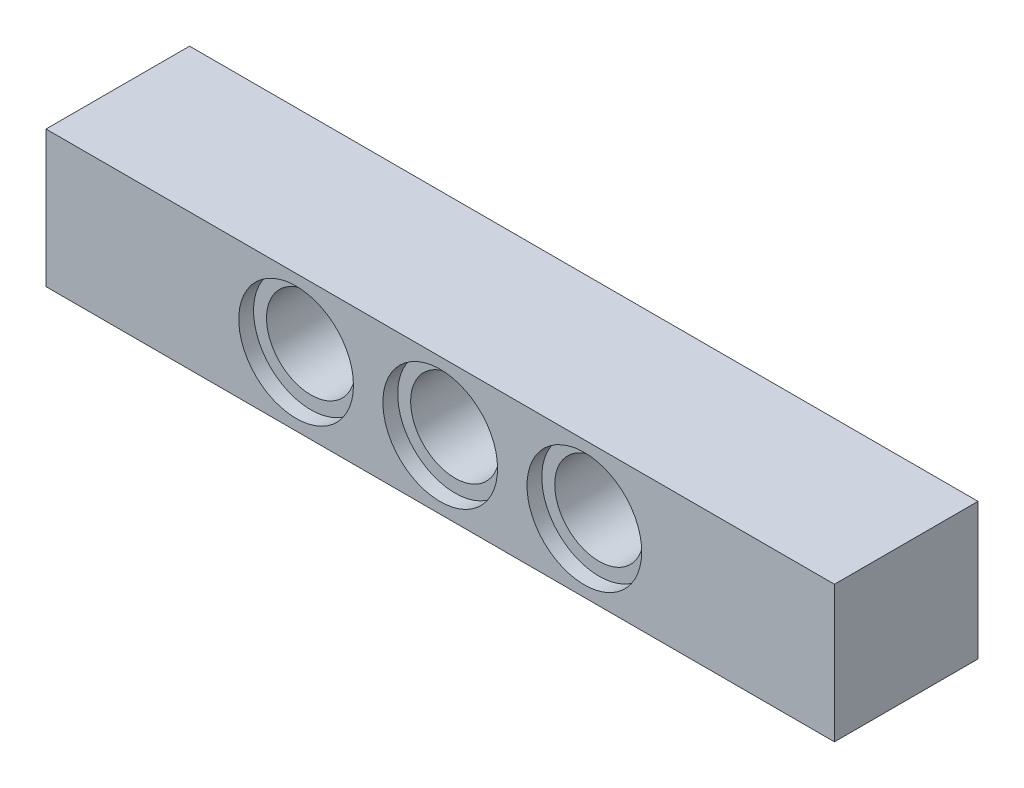
ISO-10303-21;
HEADER;
FILE_DESCRIPTION(('STEP AP214'),'2;1');
FILE_NAME('part.step','',(''),(''),'','','');
FILE_SCHEMA(('AUTOMOTIVE_DESIGN { 1 0 10303 214 1 1 1 1 }'));
ENDSEC;
DATA;
#1=APPLICATION_CONTEXT('core data for automotive mechanical design processes');
#2=APPLICATION_PROTOCOL_DEFINITION('international standard','automotive_design',2000,#1);
#3=PRODUCT_CONTEXT('',#1,'mechanical');
#4=PRODUCT('Part','Part','',(#3));
#5=PRODUCT_RELATED_PRODUCT_CATEGORY('part','',(#4));
#6=PRODUCT_DEFINITION_FORMATION('','',#4);
#7=PRODUCT_DEFINITION_CONTEXT('part definition',#1,'design');
#8=PRODUCT_DEFINITION('design','',#6,#7);
#9=PRODUCT_DEFINITION_SHAPE('','',#8);
#10=(LENGTH_UNIT() NAMED_UNIT(*) SI_UNIT(.MILLI.,.METRE.));
#11=(NAMED_UNIT(*) PLANE_ANGLE_UNIT() SI_UNIT($,.RADIAN.));
#12=(NAMED_UNIT(*) SI_UNIT($,.STERADIAN.) SOLID_ANGLE_UNIT());
#13=UNCERTAINTY_MEASURE_WITH_UNIT(LENGTH_MEASURE(1.E-05),#10,'distance_accuracy_value','');
#14=(GEOMETRIC_REPRESENTATION_CONTEXT(3) GLOBAL_UNCERTAINTY_ASSIGNED_CONTEXT((#13)) GLOBAL_UNIT_ASSIGNED_CONTEXT((#10,
#11,#12)) REPRESENTATION_CONTEXT('',''));
#15=CARTESIAN_POINT('',(0.,0.,0.));
#16=DIRECTION('',(0.,0.,1.));
#17=DIRECTION('',(1.,0.,0.));
#18=AXIS2_PLACEMENT_3D('',#15,#16,#17);
#19=CARTESIAN_POINT('',(27.29,3.69,0.));
#20=DIRECTION('',(0.,0.,1.));
#21=DIRECTION('',(1.,0.,0.));
#22=AXIS2_PLACEMENT_3D('',#19,#20,#21);
#23=CYLINDRICAL_SURFACE('',#22,3.1);
#24=CARTESIAN_POINT('',(27.29,3.69,0.));
#25=DIRECTION('',(0.,0.,1.));
#26=DIRECTION('',(1.,0.,0.));
#27=AXIS2_PLACEMENT_3D('',#24,#25,#26);
#28=CIRCLE('',#27,3.1);
#29=CARTESIAN_POINT('',(30.39,3.69,0.));
#30=VERTEX_POINT('',#29);
#31=EDGE_CURVE('E12',#30,#30,#28,.T.);
#32=ORIENTED_EDGE('',*,*,#31,.F.);
#33=EDGE_LOOP('',(#32));
#34=FACE_BOUND('',#33,.T.);
#35=CARTESIAN_POINT('',(27.29,3.69,0.8));
#36=DIRECTION('',(0.,0.,1.));
#37=DIRECTION('',(1.,0.,0.));
#38=AXIS2_PLACEMENT_3D('',#35,#36,#37);
#39=CIRCLE('',#38,3.1);
#40=CARTESIAN_POINT('',(30.39,3.69,0.8));
#41=VERTEX_POINT('',#40);
#42=EDGE_CURVE('E45',#41,#41,#39,.T.);
#43=ORIENTED_EDGE('',*,*,#42,.T.);
#44=EDGE_LOOP('',(#43));
#45=FACE_BOUND('',#44,.T.);
#46=ADVANCED_FACE('F37',(#34,#45),#23,.F.);
#47=CARTESIAN_POINT('',(7.79,0.,0.8));
#48=DIRECTION('',(0.,0.,1.));
#49=DIRECTION('',(1.,0.,0.));
#50=AXIS2_PLACEMENT_3D('',#47,#48,#49);
#51=PLANE('',#50);
#52=ORIENTED_EDGE('',*,*,#42,.F.);
#53=EDGE_LOOP('',(#52));
#54=FACE_BOUND('',#53,.T.);
#55=CARTESIAN_POINT('',(27.29,3.69,0.8));
#56=DIRECTION('',(0.,0.,1.));
#57=DIRECTION('',(1.,0.,0.));
#58=AXIS2_PLACEMENT_3D('',#55,#56,#57);
#59=CIRCLE('',#58,2.4);
#60=CARTESIAN_POINT('',(29.69,3.69,0.8));
#61=VERTEX_POINT('',#60);
#62=EDGE_CURVE('E154',#61,#61,#59,.F.);
#63=ORIENTED_EDGE('',*,*,#62,.F.);
#64=EDGE_LOOP('',(#63));
#65=FACE_BOUND('',#64,.T.);
#66=ADVANCED_FACE('F166',(#54,#65),#51,.F.);
#67=CARTESIAN_POINT('',(7.79,0.,6.95999999999999));
#68=DIRECTION('',(0.,0.,-1.));
#69=DIRECTION('',(-1.,0.,0.));
#70=AXIS2_PLACEMENT_3D('',#67,#68,#69);
#71=PLANE('',#70);
#72=CARTESIAN_POINT('',(27.29,3.69,6.96));
#73=DIRECTION('',(0.,0.,1.));
#74=DIRECTION('',(1.,0.,0.));
#75=AXIS2_PLACEMENT_3D('',#72,#73,#74);
#76=CIRCLE('',#75,3.1);
#77=CARTESIAN_POINT('',(30.39,3.69,6.96));
#78=VERTEX_POINT('',#77);
#79=EDGE_CURVE('E160',#78,#78,#76,.T.);
#80=ORIENTED_EDGE('',*,*,#79,.T.);
#81=EDGE_LOOP('',(#80));
#82=FACE_BOUND('',#81,.T.);
#83=CARTESIAN_POINT('',(27.29,3.69,6.95999999999999));
#84=DIRECTION('',(0.,0.,-1.));
#85=DIRECTION('',(-1.,0.,0.));
#86=AXIS2_PLACEMENT_3D('',#83,#84,#85);
#87=CIRCLE('',#86,2.4);
#88=CARTESIAN_POINT('',(24.89,3.69,6.95999999999999));
#89=VERTEX_POINT('',#88);
#90=EDGE_CURVE('E151',#89,#89,#87,.F.);
#91=ORIENTED_EDGE('',*,*,#90,.F.);
#92=EDGE_LOOP('',(#91));
#93=FACE_BOUND('',#92,.T.);
#94=ADVANCED_FACE('F169',(#82,#93),#71,.F.);
#95=CARTESIAN_POINT('',(27.29,3.69,7.76));
#96=DIRECTION('',(0.,0.,-1.));
#97=DIRECTION('',(-1.,0.,0.));
#98=AXIS2_PLACEMENT_3D('',#95,#96,#97);
#99=CYLINDRICAL_SURFACE('',#98,3.1);
#100=CARTESIAN_POINT('',(27.29,3.69,7.76));
#101=DIRECTION('',(0.,0.,1.));
#102=DIRECTION('',(1.,0.,0.));
#103=AXIS2_PLACEMENT_3D('',#100,#101,#102);
#104=CIRCLE('',#103,3.1);
#105=CARTESIAN_POINT('',(30.39,3.69,7.76));
#106=VERTEX_POINT('',#105);
#107=EDGE_CURVE('E157',#106,#106,#104,.T.);
#108=ORIENTED_EDGE('',*,*,#107,.T.);
#109=EDGE_LOOP('',(#108));
#110=FACE_BOUND('',#109,.T.);
#111=ORIENTED_EDGE('',*,*,#79,.F.);
#112=EDGE_LOOP('',(#111));
#113=FACE_BOUND('',#112,.T.);
#114=ADVANCED_FACE('F175',(#110,#113),#99,.F.);
#115=CARTESIAN_POINT('',(27.29,3.69,0.));
#116=DIRECTION('',(0.,0.,1.));
#117=DIRECTION('',(1.,0.,0.));
#118=AXIS2_PLACEMENT_3D('',#115,#116,#117);
#119=CYLINDRICAL_SURFACE('',#118,2.4);
#120=ORIENTED_EDGE('',*,*,#90,.T.);
#121=EDGE_LOOP('',(#120));
#122=FACE_BOUND('',#121,.T.);
#123=ORIENTED_EDGE('',*,*,#62,.T.);
#124=EDGE_LOOP('',(#123));
#125=FACE_BOUND('',#124,.T.);
#126=ADVANCED_FACE('F172',(#122,#125),#119,.F.);
#127=CARTESIAN_POINT('',(11.71,3.69,7.76));
#128=DIRECTION('',(0.,0.,-1.));
#129=DIRECTION('',(-1.,0.,0.));
#130=AXIS2_PLACEMENT_3D('',#127,#128,#129);
#131=CYLINDRICAL_SURFACE('',#130,3.1);
#132=CARTESIAN_POINT('',(11.71,3.69,7.76));
#133=DIRECTION('',(0.,0.,1.));
#134=DIRECTION('',(1.,0.,0.));
#135=AXIS2_PLACEMENT_3D('',#132,#133,#134);
#136=CIRCLE('',#135,3.1);
#137=CARTESIAN_POINT('',(14.81,3.69,7.76));
#138=VERTEX_POINT('',#137);
#139=EDGE_CURVE('E148',#138,#138,#136,.T.);
#140=ORIENTED_EDGE('',*,*,#139,.T.);
#141=EDGE_LOOP('',(#140));
#142=FACE_BOUND('',#141,.T.);
#143=CARTESIAN_POINT('',(11.71,3.69,6.96));
#144=DIRECTION('',(0.,0.,1.));
#145=DIRECTION('',(1.,0.,0.));
#146=AXIS2_PLACEMENT_3D('',#143,#144,#145);
#147=CIRCLE('',#146,3.1);
#148=CARTESIAN_POINT('',(14.81,3.69,6.96));
#149=VERTEX_POINT('',#148);
#150=EDGE_CURVE('E139',#149,#149,#147,.T.);
#151=ORIENTED_EDGE('',*,*,#150,.F.);
#152=EDGE_LOOP('',(#151));
#153=FACE_BOUND('',#152,.T.);
#154=ADVANCED_FACE('F174',(#142,#153),#131,.F.);
#155=CARTESIAN_POINT('',(-7.79,0.,0.8));
#156=DIRECTION('',(0.,0.,1.));
#157=DIRECTION('',(1.,0.,0.));
#158=AXIS2_PLACEMENT_3D('',#155,#156,#157);
#159=PLANE('',#158);
#160=CARTESIAN_POINT('',(11.71,3.69,0.8));
#161=DIRECTION('',(0.,0.,1.));
#162=DIRECTION('',(1.,0.,0.));
#163=AXIS2_PLACEMENT_3D('',#160,#161,#162);
#164=CIRCLE('',#163,3.1);
#165=CARTESIAN_POINT('',(14.81,3.69,0.8));
#166=VERTEX_POINT('',#165);
#167=EDGE_CURVE('E145',#166,#166,#164,.T.);
#168=ORIENTED_EDGE('',*,*,#167,.F.);
#169=EDGE_LOOP('',(#168));
#170=FACE_BOUND('',#169,.T.);
#171=CARTESIAN_POINT('',(11.71,3.69,0.8));
#172=DIRECTION('',(0.,0.,1.));
#173=DIRECTION('',(1.,0.,0.));
#174=AXIS2_PLACEMENT_3D('',#171,#172,#173);
#175=CIRCLE('',#174,2.4);
#176=CARTESIAN_POINT('',(14.11,3.69,0.8));
#177=VERTEX_POINT('',#176);
#178=EDGE_CURVE('E136',#177,#177,#175,.F.);
#179=ORIENTED_EDGE('',*,*,#178,.F.);
#180=EDGE_LOOP('',(#179));
#181=FACE_BOUND('',#180,.T.);
#182=ADVANCED_FACE('F182',(#170,#181),#159,.F.);
#183=CARTESIAN_POINT('',(11.71,3.69,0.));
#184=DIRECTION('',(0.,0.,1.));
#185=DIRECTION('',(1.,0.,0.));
#186=AXIS2_PLACEMENT_3D('',#183,#184,#185);
#187=CYLINDRICAL_SURFACE('',#186,3.1);
#188=CARTESIAN_POINT('',(11.71,3.69,0.));
#189=DIRECTION('',(0.,0.,1.));
#190=DIRECTION('',(1.,0.,0.));
#191=AXIS2_PLACEMENT_3D('',#188,#189,#190);
#192=CIRCLE('',#191,3.1);
#193=CARTESIAN_POINT('',(14.81,3.69,0.));
#194=VERTEX_POINT('',#193);
#195=EDGE_CURVE('E142',#194,#194,#192,.T.);
#196=ORIENTED_EDGE('',*,*,#195,.F.);
#197=EDGE_LOOP('',(#196));
#198=FACE_BOUND('',#197,.T.);
#199=ORIENTED_EDGE('',*,*,#167,.T.);
#200=EDGE_LOOP('',(#199));
#201=FACE_BOUND('',#200,.T.);
#202=ADVANCED_FACE('F235',(#198,#201),#187,.F.);
#203=CARTESIAN_POINT('',(-7.79,0.,6.95999999999999));
#204=DIRECTION('',(0.,0.,-1.));
#205=DIRECTION('',(-1.,0.,0.));
#206=AXIS2_PLACEMENT_3D('',#203,#204,#205);
#207=PLANE('',#206);
#208=ORIENTED_EDGE('',*,*,#150,.T.);
#209=EDGE_LOOP('',(#208));
#210=FACE_BOUND('',#209,.T.);
#211=CARTESIAN_POINT('',(11.71,3.69,6.95999999999999));
#212=DIRECTION('',(0.,0.,-1.));
#213=DIRECTION('',(-1.,0.,0.));
#214=AXIS2_PLACEMENT_3D('',#211,#212,#213);
#215=CIRCLE('',#214,2.4);
#216=CARTESIAN_POINT('',(9.31,3.69,6.95999999999999));
#217=VERTEX_POINT('',#216);
#218=EDGE_CURVE('E128',#217,#217,#215,.F.);
#219=ORIENTED_EDGE('',*,*,#218,.F.);
#220=EDGE_LOOP('',(#219));
#221=FACE_BOUND('',#220,.T.);
#222=ADVANCED_FACE('F231',(#210,#221),#207,.F.);
#223=CARTESIAN_POINT('',(11.71,3.69,0.));
#224=DIRECTION('',(0.,0.,1.));
#225=DIRECTION('',(1.,0.,0.));
#226=AXIS2_PLACEMENT_3D('',#223,#224,#225);
#227=CYLINDRICAL_SURFACE('',#226,2.4);
#228=ORIENTED_EDGE('',*,*,#218,.T.);
#229=EDGE_LOOP('',(#228));
#230=FACE_BOUND('',#229,.T.);
#231=ORIENTED_EDGE('',*,*,#178,.T.);
#232=EDGE_LOOP('',(#231));
#233=FACE_BOUND('',#232,.T.);
#234=ADVANCED_FACE('F228',(#230,#233),#227,.F.);
#235=CARTESIAN_POINT('',(0.,0.,7.76));
#236=DIRECTION('',(0.,1.,0.));
#237=DIRECTION('',(0.,0.,1.));
#238=AXIS2_PLACEMENT_3D('',#235,#236,#237);
#239=PLANE('',#238);
#240=DIRECTION('',(1.,0.,0.));
#241=VECTOR('',#240,1.);
#242=CARTESIAN_POINT('',(0.,0.,0.));
#243=LINE('',#242,#241);
#244=CARTESIAN_POINT('',(-1.81000000000004,0.,0.));
#245=VERTEX_POINT('',#244);
#246=CARTESIAN_POINT('',(40.81,0.,0.));
#247=VERTEX_POINT('',#246);
#248=EDGE_CURVE('E86',#245,#247,#243,.T.);
#249=ORIENTED_EDGE('',*,*,#248,.T.);
#250=DIRECTION('',(0.,0.,-1.));
#251=VECTOR('',#250,1.);
#252=CARTESIAN_POINT('',(40.81,0.,7.76));
#253=LINE('',#252,#251);
#254=CARTESIAN_POINT('',(40.81,0.,7.76));
#255=VERTEX_POINT('',#254);
#256=EDGE_CURVE('E108',#255,#247,#253,.T.);
#257=ORIENTED_EDGE('',*,*,#256,.F.);
#258=DIRECTION('',(1.,0.,0.));
#259=VECTOR('',#258,1.);
#260=CARTESIAN_POINT('',(0.,0.,7.76));
#261=LINE('',#260,#259);
#262=CARTESIAN_POINT('',(-1.81000000000004,0.,7.76));
#263=VERTEX_POINT('',#262);
#264=EDGE_CURVE('E53',#263,#255,#261,.T.);
#265=ORIENTED_EDGE('',*,*,#264,.F.);
#266=DIRECTION('',(0.,0.,-1.));
#267=VECTOR('',#266,1.);
#268=CARTESIAN_POINT('',(-1.81000000000004,0.,7.76));
#269=LINE('',#268,#267);
#270=EDGE_CURVE('E95',#263,#245,#269,.T.);
#271=ORIENTED_EDGE('',*,*,#270,.T.);
#272=EDGE_LOOP('',(#249,#257,#265,#271));
#273=FACE_BOUND('',#272,.T.);
#274=ADVANCED_FACE('F225',(#273),#239,.F.);
#275=CARTESIAN_POINT('',(0.,7.38,7.76));
#276=DIRECTION('',(0.,-1.,0.));
#277=DIRECTION('',(0.,0.,-1.));
#278=AXIS2_PLACEMENT_3D('',#275,#276,#277);
#279=PLANE('',#278);
#280=DIRECTION('',(-1.,0.,0.));
#281=VECTOR('',#280,1.);
#282=CARTESIAN_POINT('',(0.,7.38,7.76));
#283=LINE('',#282,#281);
#284=CARTESIAN_POINT('',(40.81,7.38,7.76));
#285=VERTEX_POINT('',#284);
#286=CARTESIAN_POINT('',(-1.81000000000004,7.38,7.76));
#287=VERTEX_POINT('',#286);
#288=EDGE_CURVE('E71',#285,#287,#283,.T.);
#289=ORIENTED_EDGE('',*,*,#288,.F.);
#290=DIRECTION('',(0.,0.,-1.));
#291=VECTOR('',#290,1.);
#292=CARTESIAN_POINT('',(40.81,7.38,7.76));
#293=LINE('',#292,#291);
#294=CARTESIAN_POINT('',(40.81,7.38,0.));
#295=VERTEX_POINT('',#294);
#296=EDGE_CURVE('E84',#285,#295,#293,.T.);
#297=ORIENTED_EDGE('',*,*,#296,.T.);
#298=DIRECTION('',(-1.,0.,0.));
#299=VECTOR('',#298,1.);
#300=CARTESIAN_POINT('',(0.,7.38,0.));
#301=LINE('',#300,#299);
#302=CARTESIAN_POINT('',(-1.81000000000004,7.38,0.));
#303=VERTEX_POINT('',#302);
#304=EDGE_CURVE('E65',#295,#303,#301,.T.);
#305=ORIENTED_EDGE('',*,*,#304,.T.);
#306=DIRECTION('',(0.,0.,-1.));
#307=VECTOR('',#306,1.);
#308=CARTESIAN_POINT('',(-1.81000000000004,7.38,7.76));
#309=LINE('',#308,#307);
#310=EDGE_CURVE('E81',#287,#303,#309,.T.);
#311=ORIENTED_EDGE('',*,*,#310,.F.);
#312=EDGE_LOOP('',(#289,#297,#305,#311));
#313=FACE_BOUND('',#312,.T.);
#314=ADVANCED_FACE('F80',(#313),#279,.F.);
#315=CARTESIAN_POINT('',(0.,0.,7.76));
#316=DIRECTION('',(0.,0.,-1.));
#317=DIRECTION('',(-1.,0.,0.));
#318=AXIS2_PLACEMENT_3D('',#315,#316,#317);
#319=PLANE('',#318);
#320=DIRECTION('',(0.,1.,0.));
#321=VECTOR('',#320,1.);
#322=CARTESIAN_POINT('',(-1.81000000000004,0.,7.76));
#323=LINE('',#322,#321);
#324=EDGE_CURVE('E93',#263,#287,#323,.T.);
#325=ORIENTED_EDGE('',*,*,#324,.F.);
#326=ORIENTED_EDGE('',*,*,#264,.T.);
#327=DIRECTION('',(0.,-1.,0.));
#328=VECTOR('',#327,1.);
#329=CARTESIAN_POINT('',(40.81,0.,7.76));
#330=LINE('',#329,#328);
#331=EDGE_CURVE('E104',#285,#255,#330,.T.);
#332=ORIENTED_EDGE('',*,*,#331,.F.);
#333=ORIENTED_EDGE('',*,*,#288,.T.);
#334=EDGE_LOOP('',(#325,#326,#332,#333));
#335=FACE_BOUND('',#334,.T.);
#336=ORIENTED_EDGE('',*,*,#107,.F.);
#337=EDGE_LOOP('',(#336));
#338=FACE_BOUND('',#337,.T.);
#339=ORIENTED_EDGE('',*,*,#139,.F.);
#340=EDGE_LOOP('',(#339));
#341=FACE_BOUND('',#340,.T.);
#342=CARTESIAN_POINT('',(19.5,3.69,7.76));
#343=DIRECTION('',(0.,0.,1.));
#344=DIRECTION('',(1.,0.,0.));
#345=AXIS2_PLACEMENT_3D('',#342,#343,#344);
#346=CIRCLE('',#345,3.1);
#347=CARTESIAN_POINT('',(22.6,3.69,7.76));
#348=VERTEX_POINT('',#347);
#349=EDGE_CURVE('E111',#348,#348,#346,.T.);
#350=ORIENTED_EDGE('',*,*,#349,.F.);
#351=EDGE_LOOP('',(#350));
#352=FACE_BOUND('',#351,.T.);
#353=ADVANCED_FACE('F195',(#335,#338,#341,#352),#319,.F.);
#354=CARTESIAN_POINT('',(0.,0.,0.));
#355=DIRECTION('',(0.,0.,-1.));
#356=DIRECTION('',(-1.,0.,0.));
#357=AXIS2_PLACEMENT_3D('',#354,#355,#356);
#358=PLANE('',#357);
#359=ORIENTED_EDGE('',*,*,#248,.F.);
#360=DIRECTION('',(0.,1.,0.));
#361=VECTOR('',#360,1.);
#362=CARTESIAN_POINT('',(-1.81000000000004,0.,0.));
#363=LINE('',#362,#361);
#364=EDGE_CURVE('E92',#245,#303,#363,.T.);
#365=ORIENTED_EDGE('',*,*,#364,.T.);
#366=ORIENTED_EDGE('',*,*,#304,.F.);
#367=DIRECTION('',(0.,-1.,0.));
#368=VECTOR('',#367,1.);
#369=CARTESIAN_POINT('',(40.81,0.,0.));
#370=LINE('',#369,#368);
#371=EDGE_CURVE('E94',#295,#247,#370,.T.);
#372=ORIENTED_EDGE('',*,*,#371,.T.);
#373=EDGE_LOOP('',(#359,#365,#366,#372));
#374=FACE_BOUND('',#373,.T.);
#375=ORIENTED_EDGE('',*,*,#31,.T.);
#376=EDGE_LOOP('',(#375));
#377=FACE_BOUND('',#376,.T.);
#378=ORIENTED_EDGE('',*,*,#195,.T.);
#379=EDGE_LOOP('',(#378));
#380=FACE_BOUND('',#379,.T.);
#381=CARTESIAN_POINT('',(19.5,3.69,0.));
#382=DIRECTION('',(0.,0.,1.));
#383=DIRECTION('',(1.,0.,0.));
#384=AXIS2_PLACEMENT_3D('',#381,#382,#383);
#385=CIRCLE('',#384,3.1);
#386=CARTESIAN_POINT('',(22.6,3.69,0.));
#387=VERTEX_POINT('',#386);
#388=EDGE_CURVE('E119',#387,#387,#385,.T.);
#389=ORIENTED_EDGE('',*,*,#388,.T.);
#390=EDGE_LOOP('',(#389));
#391=FACE_BOUND('',#390,.T.);
#392=ADVANCED_FACE('F97',(#374,#377,#380,#391),#358,.T.);
#393=CARTESIAN_POINT('',(19.5,3.69,0.));
#394=DIRECTION('',(0.,0.,1.));
#395=DIRECTION('',(1.,0.,0.));
#396=AXIS2_PLACEMENT_3D('',#393,#394,#395);
#397=CYLINDRICAL_SURFACE('',#396,2.4);
#398=CARTESIAN_POINT('',(19.5,3.69,6.95999999999999));
#399=DIRECTION('',(0.,0.,-1.));
#400=DIRECTION('',(-1.,0.,0.));
#401=AXIS2_PLACEMENT_3D('',#398,#399,#400);
#402=CIRCLE('',#401,2.4);
#403=CARTESIAN_POINT('',(17.1,3.69,6.95999999999999));
#404=VERTEX_POINT('',#403);
#405=EDGE_CURVE('E118',#404,#404,#402,.F.);
#406=ORIENTED_EDGE('',*,*,#405,.T.);
#407=EDGE_LOOP('',(#406));
#408=FACE_BOUND('',#407,.T.);
#409=CARTESIAN_POINT('',(19.5,3.69,0.8));
#410=DIRECTION('',(0.,0.,1.));
#411=DIRECTION('',(1.,0.,0.));
#412=AXIS2_PLACEMENT_3D('',#409,#410,#411);
#413=CIRCLE('',#412,2.4);
#414=CARTESIAN_POINT('',(21.9,3.69,0.8));
#415=VERTEX_POINT('',#414);
#416=EDGE_CURVE('E125',#415,#415,#413,.F.);
#417=ORIENTED_EDGE('',*,*,#416,.T.);
#418=EDGE_LOOP('',(#417));
#419=FACE_BOUND('',#418,.T.);
#420=ADVANCED_FACE('F194',(#408,#419),#397,.F.);
#421=CARTESIAN_POINT('',(0.,0.,0.8));
#422=DIRECTION('',(0.,0.,1.));
#423=DIRECTION('',(1.,0.,0.));
#424=AXIS2_PLACEMENT_3D('',#421,#422,#423);
#425=PLANE('',#424);
#426=CARTESIAN_POINT('',(19.5,3.69,0.8));
#427=DIRECTION('',(0.,0.,1.));
#428=DIRECTION('',(1.,0.,0.));
#429=AXIS2_PLACEMENT_3D('',#426,#427,#428);
#430=CIRCLE('',#429,3.1);
#431=CARTESIAN_POINT('',(22.6,3.69,0.8));
#432=VERTEX_POINT('',#431);
#433=EDGE_CURVE('E122',#432,#432,#430,.T.);
#434=ORIENTED_EDGE('',*,*,#433,.F.);
#435=EDGE_LOOP('',(#434));
#436=FACE_BOUND('',#435,.T.);
#437=ORIENTED_EDGE('',*,*,#416,.F.);
#438=EDGE_LOOP('',(#437));
#439=FACE_BOUND('',#438,.T.);
#440=ADVANCED_FACE('F205',(#436,#439),#425,.F.);
#441=CARTESIAN_POINT('',(19.5,3.69,0.));
#442=DIRECTION('',(0.,0.,1.));
#443=DIRECTION('',(1.,0.,0.));
#444=AXIS2_PLACEMENT_3D('',#441,#442,#443);
#445=CYLINDRICAL_SURFACE('',#444,3.1);
#446=ORIENTED_EDGE('',*,*,#388,.F.);
#447=EDGE_LOOP('',(#446));
#448=FACE_BOUND('',#447,.T.);
#449=ORIENTED_EDGE('',*,*,#433,.T.);
#450=EDGE_LOOP('',(#449));
#451=FACE_BOUND('',#450,.T.);
#452=ADVANCED_FACE('F201',(#448,#451),#445,.F.);
#453=CARTESIAN_POINT('',(0.,0.,6.95999999999999));
#454=DIRECTION('',(0.,0.,-1.));
#455=DIRECTION('',(-1.,0.,0.));
#456=AXIS2_PLACEMENT_3D('',#453,#454,#455);
#457=PLANE('',#456);
#458=CARTESIAN_POINT('',(19.5,3.69,6.96));
#459=DIRECTION('',(0.,0.,1.));
#460=DIRECTION('',(1.,0.,0.));
#461=AXIS2_PLACEMENT_3D('',#458,#459,#460);
#462=CIRCLE('',#461,3.1);
#463=CARTESIAN_POINT('',(22.6,3.69,6.96));
#464=VERTEX_POINT('',#463);
#465=EDGE_CURVE('E115',#464,#464,#462,.T.);
#466=ORIENTED_EDGE('',*,*,#465,.T.);
#467=EDGE_LOOP('',(#466));
#468=FACE_BOUND('',#467,.T.);
#469=ORIENTED_EDGE('',*,*,#405,.F.);
#470=EDGE_LOOP('',(#469));
#471=FACE_BOUND('',#470,.T.);
#472=ADVANCED_FACE('F204',(#468,#471),#457,.F.);
#473=CARTESIAN_POINT('',(19.5,3.69,7.76));
#474=DIRECTION('',(0.,0.,-1.));
#475=DIRECTION('',(-1.,0.,0.));
#476=AXIS2_PLACEMENT_3D('',#473,#474,#475);
#477=CYLINDRICAL_SURFACE('',#476,3.1);
#478=ORIENTED_EDGE('',*,*,#349,.T.);
#479=EDGE_LOOP('',(#478));
#480=FACE_BOUND('',#479,.T.);
#481=ORIENTED_EDGE('',*,*,#465,.F.);
#482=EDGE_LOOP('',(#481));
#483=FACE_BOUND('',#482,.T.);
#484=ADVANCED_FACE('F332',(#480,#483),#477,.F.);
#485=CARTESIAN_POINT('',(40.81,0.,7.76));
#486=DIRECTION('',(1.,0.,0.));
#487=DIRECTION('',(0.,0.,-1.));
#488=AXIS2_PLACEMENT_3D('',#485,#486,#487);
#489=PLANE('',#488);
#490=ORIENTED_EDGE('',*,*,#371,.F.);
#491=ORIENTED_EDGE('',*,*,#296,.F.);
#492=ORIENTED_EDGE('',*,*,#331,.T.);
#493=ORIENTED_EDGE('',*,*,#256,.T.);
#494=EDGE_LOOP('',(#490,#491,#492,#493));
#495=FACE_BOUND('',#494,.T.);
#496=ADVANCED_FACE('F329',(#495),#489,.T.);
#497=CARTESIAN_POINT('',(-1.81000000000004,0.,7.76));
#498=DIRECTION('',(-1.,0.,0.));
#499=DIRECTION('',(0.,0.,1.));
#500=AXIS2_PLACEMENT_3D('',#497,#498,#499);
#501=PLANE('',#500);
#502=ORIENTED_EDGE('',*,*,#364,.F.);
#503=ORIENTED_EDGE('',*,*,#270,.F.);
#504=ORIENTED_EDGE('',*,*,#324,.T.);
#505=ORIENTED_EDGE('',*,*,#310,.T.);
#506=EDGE_LOOP('',(#502,#503,#504,#505));
#507=FACE_BOUND('',#506,.T.);
#508=ADVANCED_FACE('F90',(#507),#501,.T.);
#509=CLOSED_SHELL('',(#46,#66,#94,#114,#126,#154,#182,#202,#222,#234,#274,#314,#353,#392,#420,
#440,#452,#472,#484,#496,#508));
#510=MANIFOLD_SOLID_BREP('B2',#509);
#511=ADVANCED_BREP_SHAPE_REPRESENTATION('',(#18,#510),#14);
#512=SHAPE_DEFINITION_REPRESENTATION(#9,#511);
ENDSEC;
END-ISO-10303-21;
